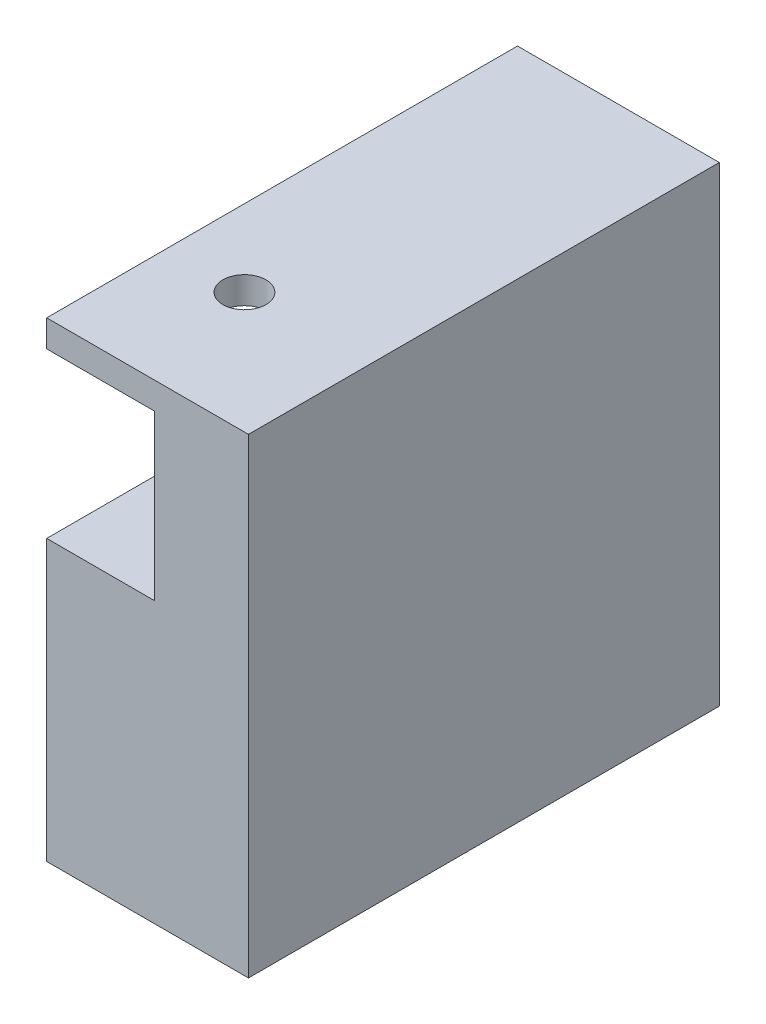
ISO-10303-21;
HEADER;
FILE_DESCRIPTION(('STEP AP214'),'2;1');
FILE_NAME('part.step','',(''),(''),'','','');
FILE_SCHEMA(('AUTOMOTIVE_DESIGN { 1 0 10303 214 1 1 1 1 }'));
ENDSEC;
DATA;
#1=APPLICATION_CONTEXT('core data for automotive mechanical design processes');
#2=APPLICATION_PROTOCOL_DEFINITION('international standard','automotive_design',2000,#1);
#3=PRODUCT_CONTEXT('',#1,'mechanical');
#4=PRODUCT('Part','Part','',(#3));
#5=PRODUCT_RELATED_PRODUCT_CATEGORY('part','',(#4));
#6=PRODUCT_DEFINITION_FORMATION('','',#4);
#7=PRODUCT_DEFINITION_CONTEXT('part definition',#1,'design');
#8=PRODUCT_DEFINITION('design','',#6,#7);
#9=PRODUCT_DEFINITION_SHAPE('','',#8);
#10=(LENGTH_UNIT() NAMED_UNIT(*) SI_UNIT(.MILLI.,.METRE.));
#11=(NAMED_UNIT(*) PLANE_ANGLE_UNIT() SI_UNIT($,.RADIAN.));
#12=(NAMED_UNIT(*) SI_UNIT($,.STERADIAN.) SOLID_ANGLE_UNIT());
#13=UNCERTAINTY_MEASURE_WITH_UNIT(LENGTH_MEASURE(1.E-05),#10,'distance_accuracy_value','');
#14=(GEOMETRIC_REPRESENTATION_CONTEXT(3) GLOBAL_UNCERTAINTY_ASSIGNED_CONTEXT((#13)) GLOBAL_UNIT_ASSIGNED_CONTEXT((#10,
#11,#12)) REPRESENTATION_CONTEXT('',''));
#15=CARTESIAN_POINT('',(0.,0.,0.));
#16=DIRECTION('',(0.,0.,1.));
#17=DIRECTION('',(1.,0.,0.));
#18=AXIS2_PLACEMENT_3D('',#15,#16,#17);
#19=CARTESIAN_POINT('',(7.5,35.,-17.5));
#20=DIRECTION('',(-1.,0.,0.));
#21=DIRECTION('',(0.,0.,1.));
#22=AXIS2_PLACEMENT_3D('',#19,#20,#21);
#23=PLANE('',#22);
#24=DIRECTION('',(0.,0.,-1.));
#25=VECTOR('',#24,1.);
#26=CARTESIAN_POINT('',(7.5,0.,-17.5));
#27=LINE('',#26,#25);
#28=CARTESIAN_POINT('',(7.50000000000001,0.,17.5));
#29=VERTEX_POINT('',#28);
#30=CARTESIAN_POINT('',(7.5,0.,-17.5));
#31=VERTEX_POINT('',#30);
#32=EDGE_CURVE('E140',#29,#31,#27,.T.);
#33=ORIENTED_EDGE('',*,*,#32,.T.);
#34=DIRECTION('',(0.,-1.,0.));
#35=VECTOR('',#34,1.);
#36=CARTESIAN_POINT('',(7.5,35.,-17.5));
#37=LINE('',#36,#35);
#38=CARTESIAN_POINT('',(7.5,35.,-17.5));
#39=VERTEX_POINT('',#38);
#40=EDGE_CURVE('E11',#39,#31,#37,.T.);
#41=ORIENTED_EDGE('',*,*,#40,.F.);
#42=DIRECTION('',(0.,0.,-1.));
#43=VECTOR('',#42,1.);
#44=CARTESIAN_POINT('',(7.5,35.,-17.5));
#45=LINE('',#44,#43);
#46=CARTESIAN_POINT('',(7.50000000000001,35.,17.5));
#47=VERTEX_POINT('',#46);
#48=EDGE_CURVE('E133',#47,#39,#45,.T.);
#49=ORIENTED_EDGE('',*,*,#48,.F.);
#50=DIRECTION('',(0.,-1.,0.));
#51=VECTOR('',#50,1.);
#52=CARTESIAN_POINT('',(7.50000000000001,35.,17.5));
#53=LINE('',#52,#51);
#54=EDGE_CURVE('E139',#47,#29,#53,.T.);
#55=ORIENTED_EDGE('',*,*,#54,.T.);
#56=EDGE_LOOP('',(#33,#41,#49,#55));
#57=FACE_BOUND('',#56,.T.);
#58=ADVANCED_FACE('F32',(#57),#23,.F.);
#59=CARTESIAN_POINT('',(-7.5,35.,-17.5));
#60=DIRECTION('',(0.,0.,1.));
#61=DIRECTION('',(1.,0.,0.));
#62=AXIS2_PLACEMENT_3D('',#59,#60,#61);
#63=PLANE('',#62);
#64=DIRECTION('',(-1.,0.,0.));
#65=VECTOR('',#64,1.);
#66=CARTESIAN_POINT('',(-7.5,0.,-17.5));
#67=LINE('',#66,#65);
#68=CARTESIAN_POINT('',(-7.5,0.,-17.5));
#69=VERTEX_POINT('',#68);
#70=EDGE_CURVE('E143',#31,#69,#67,.T.);
#71=ORIENTED_EDGE('',*,*,#70,.T.);
#72=DIRECTION('',(0.,-1.,0.));
#73=VECTOR('',#72,1.);
#74=CARTESIAN_POINT('',(-7.5,35.,-17.5));
#75=LINE('',#74,#73);
#76=CARTESIAN_POINT('',(-7.5,35.,-17.5));
#77=VERTEX_POINT('',#76);
#78=EDGE_CURVE('E40',#77,#69,#75,.T.);
#79=ORIENTED_EDGE('',*,*,#78,.F.);
#80=DIRECTION('',(-1.,0.,0.));
#81=VECTOR('',#80,1.);
#82=CARTESIAN_POINT('',(-7.5,35.,-17.5));
#83=LINE('',#82,#81);
#84=EDGE_CURVE('E83',#39,#77,#83,.T.);
#85=ORIENTED_EDGE('',*,*,#84,.F.);
#86=ORIENTED_EDGE('',*,*,#40,.T.);
#87=EDGE_LOOP('',(#71,#79,#85,#86));
#88=FACE_BOUND('',#87,.T.);
#89=ADVANCED_FACE('F193',(#88),#63,.F.);
#90=CARTESIAN_POINT('',(-7.5,35.,-17.5));
#91=DIRECTION('',(1.,0.,0.));
#92=DIRECTION('',(0.,0.,-1.));
#93=AXIS2_PLACEMENT_3D('',#90,#91,#92);
#94=PLANE('',#93);
#95=DIRECTION('',(0.,-1.,0.));
#96=VECTOR('',#95,1.);
#97=CARTESIAN_POINT('',(-7.49999999999999,33.,-0.499999999999976));
#98=LINE('',#97,#96);
#99=CARTESIAN_POINT('',(-7.49999999999999,33.,-0.499999999999976));
#100=VERTEX_POINT('',#99);
#101=CARTESIAN_POINT('',(-7.49999999999999,20.8,-0.499999999999976));
#102=VERTEX_POINT('',#101);
#103=EDGE_CURVE('E112',#100,#102,#98,.T.);
#104=ORIENTED_EDGE('',*,*,#103,.F.);
#105=DIRECTION('',(0.,0.,1.));
#106=VECTOR('',#105,1.);
#107=CARTESIAN_POINT('',(-7.49999999999999,33.,-0.499999999999976));
#108=LINE('',#107,#106);
#109=CARTESIAN_POINT('',(-7.49999999999999,33.,17.5));
#110=VERTEX_POINT('',#109);
#111=EDGE_CURVE('E144',#100,#110,#108,.T.);
#112=ORIENTED_EDGE('',*,*,#111,.T.);
#113=DIRECTION('',(0.,-1.,0.));
#114=VECTOR('',#113,1.);
#115=CARTESIAN_POINT('',(-7.49999999999999,35.,17.5));
#116=LINE('',#115,#114);
#117=CARTESIAN_POINT('',(-7.49999999999999,35.,17.5));
#118=VERTEX_POINT('',#117);
#119=EDGE_CURVE('E150',#118,#110,#116,.T.);
#120=ORIENTED_EDGE('',*,*,#119,.F.);
#121=DIRECTION('',(0.,0.,1.));
#122=VECTOR('',#121,1.);
#123=CARTESIAN_POINT('',(-7.5,35.,-17.5));
#124=LINE('',#123,#122);
#125=EDGE_CURVE('E136',#77,#118,#124,.T.);
#126=ORIENTED_EDGE('',*,*,#125,.F.);
#127=ORIENTED_EDGE('',*,*,#78,.T.);
#128=DIRECTION('',(0.,0.,1.));
#129=VECTOR('',#128,1.);
#130=CARTESIAN_POINT('',(-7.5,0.,-17.5));
#131=LINE('',#130,#129);
#132=CARTESIAN_POINT('',(-7.49999999999999,0.,17.5));
#133=VERTEX_POINT('',#132);
#134=EDGE_CURVE('E146',#69,#133,#131,.T.);
#135=ORIENTED_EDGE('',*,*,#134,.T.);
#136=CARTESIAN_POINT('',(-7.49999999999999,20.8,17.5));
#137=VERTEX_POINT('',#136);
#138=EDGE_CURVE('E126',#137,#133,#116,.T.);
#139=ORIENTED_EDGE('',*,*,#138,.F.);
#140=DIRECTION('',(0.,0.,1.));
#141=VECTOR('',#140,1.);
#142=CARTESIAN_POINT('',(-7.49999999999999,20.8,-0.499999999999976));
#143=LINE('',#142,#141);
#144=EDGE_CURVE('E47',#102,#137,#143,.T.);
#145=ORIENTED_EDGE('',*,*,#144,.F.);
#146=EDGE_LOOP('',(#104,#112,#120,#126,#127,#135,#139,#145));
#147=FACE_BOUND('',#146,.T.);
#148=ADVANCED_FACE('F124',(#147),#94,.F.);
#149=CARTESIAN_POINT('',(-7.49999999999999,35.,17.5));
#150=DIRECTION('',(0.,0.,-1.));
#151=DIRECTION('',(-1.,0.,0.));
#152=AXIS2_PLACEMENT_3D('',#149,#150,#151);
#153=PLANE('',#152);
#154=ORIENTED_EDGE('',*,*,#119,.T.);
#155=DIRECTION('',(-1.,0.,0.));
#156=VECTOR('',#155,1.);
#157=CARTESIAN_POINT('',(-7.49999999999999,33.,17.5));
#158=LINE('',#157,#156);
#159=CARTESIAN_POINT('',(0.500000000000009,33.,17.5));
#160=VERTEX_POINT('',#159);
#161=EDGE_CURVE('E121',#160,#110,#158,.T.);
#162=ORIENTED_EDGE('',*,*,#161,.F.);
#163=DIRECTION('',(0.,1.,0.));
#164=VECTOR('',#163,1.);
#165=CARTESIAN_POINT('',(0.500000000000009,33.,17.5));
#166=LINE('',#165,#164);
#167=CARTESIAN_POINT('',(0.50000000000001,20.8,17.5));
#168=VERTEX_POINT('',#167);
#169=EDGE_CURVE('E170',#168,#160,#166,.T.);
#170=ORIENTED_EDGE('',*,*,#169,.F.);
#171=DIRECTION('',(1.,0.,0.));
#172=VECTOR('',#171,1.);
#173=CARTESIAN_POINT('',(-7.49999999999999,20.8,17.5));
#174=LINE('',#173,#172);
#175=EDGE_CURVE('E173',#137,#168,#174,.T.);
#176=ORIENTED_EDGE('',*,*,#175,.F.);
#177=ORIENTED_EDGE('',*,*,#138,.T.);
#178=DIRECTION('',(1.,0.,0.));
#179=VECTOR('',#178,1.);
#180=CARTESIAN_POINT('',(-7.49999999999999,0.,17.5));
#181=LINE('',#180,#179);
#182=EDGE_CURVE('E76',#133,#29,#181,.T.);
#183=ORIENTED_EDGE('',*,*,#182,.T.);
#184=ORIENTED_EDGE('',*,*,#54,.F.);
#185=DIRECTION('',(1.,0.,0.));
#186=VECTOR('',#185,1.);
#187=CARTESIAN_POINT('',(-7.49999999999999,35.,17.5));
#188=LINE('',#187,#186);
#189=EDGE_CURVE('E56',#118,#47,#188,.T.);
#190=ORIENTED_EDGE('',*,*,#189,.F.);
#191=EDGE_LOOP('',(#154,#162,#170,#176,#177,#183,#184,#190));
#192=FACE_BOUND('',#191,.T.);
#193=ADVANCED_FACE('F163',(#192),#153,.F.);
#194=CARTESIAN_POINT('',(7.50000000000001,35.,17.5));
#195=DIRECTION('',(0.,1.,0.));
#196=DIRECTION('',(0.,0.,1.));
#197=AXIS2_PLACEMENT_3D('',#194,#195,#196);
#198=PLANE('',#197);
#199=CARTESIAN_POINT('',(-1.79999999999999,35.,8.50000000000002));
#200=DIRECTION('',(0.,1.,0.));
#201=DIRECTION('',(0.,0.,1.));
#202=AXIS2_PLACEMENT_3D('',#199,#200,#201);
#203=CIRCLE('',#202,1.6);
#204=CARTESIAN_POINT('',(-1.79999999999999,35.,10.1));
#205=VERTEX_POINT('',#204);
#206=EDGE_CURVE('E176',#205,#205,#203,.T.);
#207=ORIENTED_EDGE('',*,*,#206,.F.);
#208=EDGE_LOOP('',(#207));
#209=FACE_BOUND('',#208,.T.);
#210=ORIENTED_EDGE('',*,*,#48,.T.);
#211=ORIENTED_EDGE('',*,*,#84,.T.);
#212=ORIENTED_EDGE('',*,*,#125,.T.);
#213=ORIENTED_EDGE('',*,*,#189,.T.);
#214=EDGE_LOOP('',(#210,#211,#212,#213));
#215=FACE_BOUND('',#214,.T.);
#216=ADVANCED_FACE('F204',(#209,#215),#198,.T.);
#217=CARTESIAN_POINT('',(7.50000000000001,0.,17.5));
#218=DIRECTION('',(0.,1.,0.));
#219=DIRECTION('',(0.,0.,1.));
#220=AXIS2_PLACEMENT_3D('',#217,#218,#219);
#221=PLANE('',#220);
#222=ORIENTED_EDGE('',*,*,#32,.F.);
#223=ORIENTED_EDGE('',*,*,#182,.F.);
#224=ORIENTED_EDGE('',*,*,#134,.F.);
#225=ORIENTED_EDGE('',*,*,#70,.F.);
#226=EDGE_LOOP('',(#222,#223,#224,#225));
#227=FACE_BOUND('',#226,.T.);
#228=ADVANCED_FACE('F159',(#227),#221,.F.);
#229=CARTESIAN_POINT('',(-7.49999999999999,33.,-0.499999999999976));
#230=DIRECTION('',(0.,1.,0.));
#231=DIRECTION('',(0.,0.,1.));
#232=AXIS2_PLACEMENT_3D('',#229,#230,#231);
#233=PLANE('',#232);
#234=CARTESIAN_POINT('',(-1.79999999999999,33.,8.50000000000002));
#235=DIRECTION('',(0.,1.,0.));
#236=DIRECTION('',(0.,0.,1.));
#237=AXIS2_PLACEMENT_3D('',#234,#235,#236);
#238=CIRCLE('',#237,1.6);
#239=CARTESIAN_POINT('',(-1.79999999999999,33.,10.1));
#240=VERTEX_POINT('',#239);
#241=EDGE_CURVE('E35',#240,#240,#238,.T.);
#242=ORIENTED_EDGE('',*,*,#241,.T.);
#243=EDGE_LOOP('',(#242));
#244=FACE_BOUND('',#243,.T.);
#245=ORIENTED_EDGE('',*,*,#161,.T.);
#246=ORIENTED_EDGE('',*,*,#111,.F.);
#247=DIRECTION('',(-1.,0.,0.));
#248=VECTOR('',#247,1.);
#249=CARTESIAN_POINT('',(-7.49999999999999,33.,-0.499999999999976));
#250=LINE('',#249,#248);
#251=CARTESIAN_POINT('',(0.500000000000009,33.,-0.499999999999976));
#252=VERTEX_POINT('',#251);
#253=EDGE_CURVE('E118',#252,#100,#250,.T.);
#254=ORIENTED_EDGE('',*,*,#253,.F.);
#255=DIRECTION('',(0.,0.,1.));
#256=VECTOR('',#255,1.);
#257=CARTESIAN_POINT('',(0.500000000000009,33.,-0.499999999999976));
#258=LINE('',#257,#256);
#259=EDGE_CURVE('E128',#252,#160,#258,.T.);
#260=ORIENTED_EDGE('',*,*,#259,.T.);
#261=EDGE_LOOP('',(#245,#246,#254,#260));
#262=FACE_BOUND('',#261,.T.);
#263=ADVANCED_FACE('F183',(#244,#262),#233,.F.);
#264=CARTESIAN_POINT('',(0.500000000000009,33.,-0.499999999999976));
#265=DIRECTION('',(1.,0.,0.));
#266=DIRECTION('',(0.,1.,0.));
#267=AXIS2_PLACEMENT_3D('',#264,#265,#266);
#268=PLANE('',#267);
#269=ORIENTED_EDGE('',*,*,#169,.T.);
#270=ORIENTED_EDGE('',*,*,#259,.F.);
#271=DIRECTION('',(0.,1.,0.));
#272=VECTOR('',#271,1.);
#273=CARTESIAN_POINT('',(0.500000000000009,33.,-0.499999999999976));
#274=LINE('',#273,#272);
#275=CARTESIAN_POINT('',(0.50000000000001,20.8,-0.499999999999976));
#276=VERTEX_POINT('',#275);
#277=EDGE_CURVE('E111',#276,#252,#274,.T.);
#278=ORIENTED_EDGE('',*,*,#277,.F.);
#279=DIRECTION('',(0.,0.,1.));
#280=VECTOR('',#279,1.);
#281=CARTESIAN_POINT('',(0.50000000000001,20.8,-0.499999999999976));
#282=LINE('',#281,#280);
#283=EDGE_CURVE('E107',#276,#168,#282,.T.);
#284=ORIENTED_EDGE('',*,*,#283,.T.);
#285=EDGE_LOOP('',(#269,#270,#278,#284));
#286=FACE_BOUND('',#285,.T.);
#287=ADVANCED_FACE('F212',(#286),#268,.F.);
#288=CARTESIAN_POINT('',(-7.49999999999999,20.8,-0.499999999999976));
#289=DIRECTION('',(0.,-1.,0.));
#290=DIRECTION('',(0.,0.,-1.));
#291=AXIS2_PLACEMENT_3D('',#288,#289,#290);
#292=PLANE('',#291);
#293=ORIENTED_EDGE('',*,*,#175,.T.);
#294=ORIENTED_EDGE('',*,*,#283,.F.);
#295=DIRECTION('',(1.,0.,0.));
#296=VECTOR('',#295,1.);
#297=CARTESIAN_POINT('',(-7.49999999999999,20.8,-0.499999999999976));
#298=LINE('',#297,#296);
#299=EDGE_CURVE('E104',#102,#276,#298,.T.);
#300=ORIENTED_EDGE('',*,*,#299,.F.);
#301=ORIENTED_EDGE('',*,*,#144,.T.);
#302=EDGE_LOOP('',(#293,#294,#300,#301));
#303=FACE_BOUND('',#302,.T.);
#304=ADVANCED_FACE('F106',(#303),#292,.F.);
#305=CARTESIAN_POINT('',(-7.49999999999999,20.8,-0.499999999999976));
#306=DIRECTION('',(0.,0.,1.));
#307=DIRECTION('',(1.,0.,0.));
#308=AXIS2_PLACEMENT_3D('',#305,#306,#307);
#309=PLANE('',#308);
#310=ORIENTED_EDGE('',*,*,#103,.T.);
#311=ORIENTED_EDGE('',*,*,#299,.T.);
#312=ORIENTED_EDGE('',*,*,#277,.T.);
#313=ORIENTED_EDGE('',*,*,#253,.T.);
#314=EDGE_LOOP('',(#310,#311,#312,#313));
#315=FACE_BOUND('',#314,.T.);
#316=ADVANCED_FACE('F116',(#315),#309,.T.);
#317=CARTESIAN_POINT('',(-1.79999999999999,27.,8.50000000000002));
#318=DIRECTION('',(0.,1.,0.));
#319=DIRECTION('',(0.,0.,1.));
#320=AXIS2_PLACEMENT_3D('',#317,#318,#319);
#321=CYLINDRICAL_SURFACE('',#320,1.6);
#322=ORIENTED_EDGE('',*,*,#206,.T.);
#323=EDGE_LOOP('',(#322));
#324=FACE_BOUND('',#323,.T.);
#325=ORIENTED_EDGE('',*,*,#241,.F.);
#326=EDGE_LOOP('',(#325));
#327=FACE_BOUND('',#326,.T.);
#328=ADVANCED_FACE('F185',(#324,#327),#321,.F.);
#329=CLOSED_SHELL('',(#58,#89,#148,#193,#216,#228,#263,#287,#304,#316,#328));
#330=MANIFOLD_SOLID_BREP('B2',#329);
#331=ADVANCED_BREP_SHAPE_REPRESENTATION('',(#18,#330),#14);
#332=SHAPE_DEFINITION_REPRESENTATION(#9,#331);
ENDSEC;
END-ISO-10303-21;
